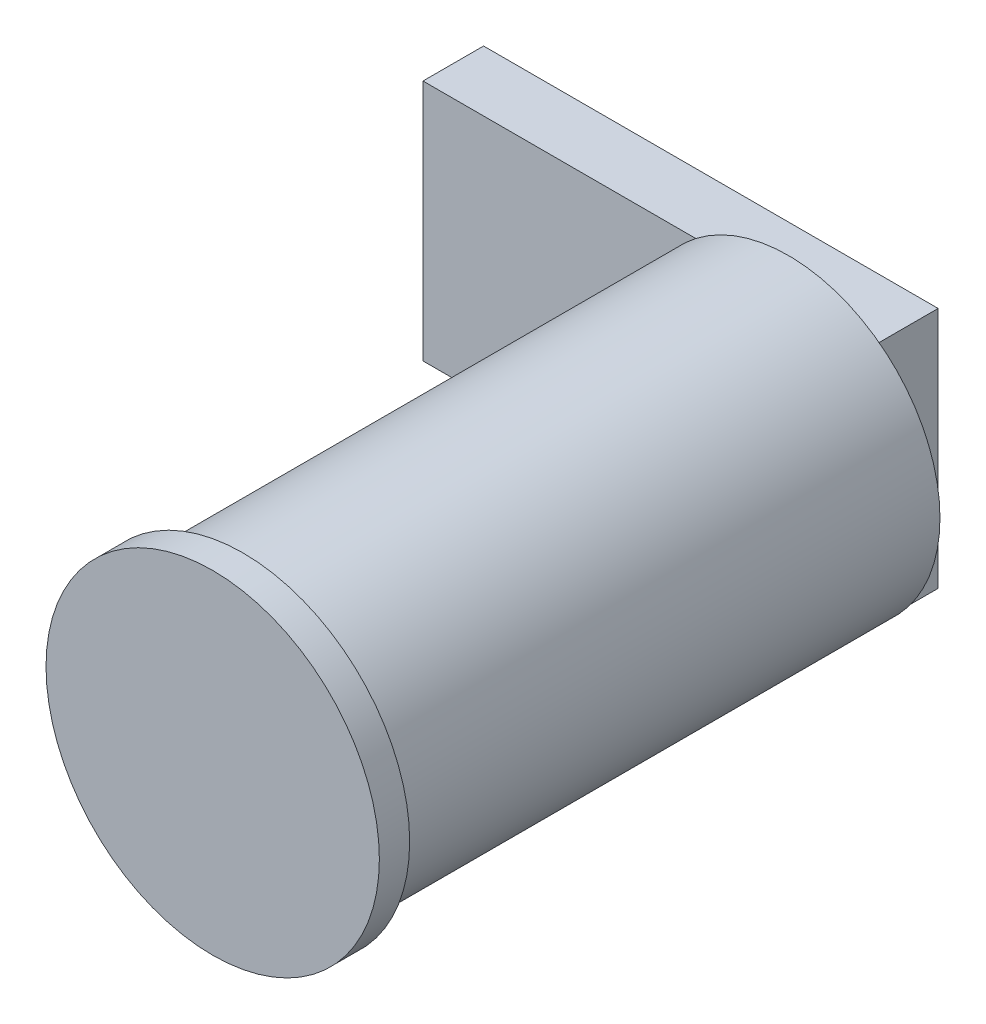
ISO-10303-21;
HEADER;
FILE_DESCRIPTION(('STEP AP214'),'2;1');
FILE_NAME('part.step','',(''),(''),'','','');
FILE_SCHEMA(('AUTOMOTIVE_DESIGN { 1 0 10303 214 1 1 1 1 }'));
ENDSEC;
DATA;
#1=APPLICATION_CONTEXT('core data for automotive mechanical design processes');
#2=APPLICATION_PROTOCOL_DEFINITION('international standard','automotive_design',2000,#1);
#3=PRODUCT_CONTEXT('',#1,'mechanical');
#4=PRODUCT('Part','Part','',(#3));
#5=PRODUCT_RELATED_PRODUCT_CATEGORY('part','',(#4));
#6=PRODUCT_DEFINITION_FORMATION('','',#4);
#7=PRODUCT_DEFINITION_CONTEXT('part definition',#1,'design');
#8=PRODUCT_DEFINITION('design','',#6,#7);
#9=PRODUCT_DEFINITION_SHAPE('','',#8);
#10=(LENGTH_UNIT() NAMED_UNIT(*) SI_UNIT(.MILLI.,.METRE.));
#11=(NAMED_UNIT(*) PLANE_ANGLE_UNIT() SI_UNIT($,.RADIAN.));
#12=(NAMED_UNIT(*) SI_UNIT($,.STERADIAN.) SOLID_ANGLE_UNIT());
#13=UNCERTAINTY_MEASURE_WITH_UNIT(LENGTH_MEASURE(1.E-05),#10,'distance_accuracy_value','');
#14=(GEOMETRIC_REPRESENTATION_CONTEXT(3) GLOBAL_UNCERTAINTY_ASSIGNED_CONTEXT((#13)) GLOBAL_UNIT_ASSIGNED_CONTEXT((#10,
#11,#12)) REPRESENTATION_CONTEXT('',''));
#15=CARTESIAN_POINT('',(0.,0.,0.));
#16=DIRECTION('',(0.,0.,1.));
#17=DIRECTION('',(1.,0.,0.));
#18=AXIS2_PLACEMENT_3D('',#15,#16,#17);
#19=CARTESIAN_POINT('',(0.,0.,-19.));
#20=DIRECTION('',(0.,0.,1.));
#21=DIRECTION('',(1.,0.,0.));
#22=AXIS2_PLACEMENT_3D('',#19,#20,#21);
#23=PLANE('',#22);
#24=DIRECTION('',(1.,0.,0.));
#25=VECTOR('',#24,1.);
#26=CARTESIAN_POINT('',(2.93924574656835,3.95576033997713,-19.));
#27=LINE('',#26,#25);
#28=CARTESIAN_POINT('',(-3.05809746945123,3.95576033997713,-19.));
#29=VERTEX_POINT('',#28);
#30=CARTESIAN_POINT('',(2.93924574656835,3.95576033997713,-19.));
#31=VERTEX_POINT('',#30);
#32=EDGE_CURVE('E11',#29,#31,#27,.T.);
#33=ORIENTED_EDGE('',*,*,#32,.F.);
#34=CARTESIAN_POINT('',(0.,0.,-19.));
#35=DIRECTION('',(0.,0.,1.));
#36=DIRECTION('',(1.,0.,0.));
#37=AXIS2_PLACEMENT_3D('',#34,#35,#36);
#38=CIRCLE('',#37,5.);
#39=CARTESIAN_POINT('',(2.93924574656835,-4.04485283308057,-19.));
#40=VERTEX_POINT('',#39);
#41=EDGE_CURVE('E104',#40,#29,#38,.T.);
#42=ORIENTED_EDGE('',*,*,#41,.F.);
#43=DIRECTION('',(0.,-1.,0.));
#44=VECTOR('',#43,1.);
#45=CARTESIAN_POINT('',(2.93924574656835,-4.04485283308057,-19.));
#46=LINE('',#45,#44);
#47=EDGE_CURVE('E51',#31,#40,#46,.T.);
#48=ORIENTED_EDGE('',*,*,#47,.F.);
#49=EDGE_LOOP('',(#33,#42,#48));
#50=FACE_BOUND('',#49,.T.);
#51=ADVANCED_FACE('F33',(#50),#23,.F.);
#52=DIRECTION('',(-1.,0.,0.));
#53=VECTOR('',#52,1.);
#54=CARTESIAN_POINT('',(2.93924574656835,-4.04485283308057,-19.));
#55=LINE('',#54,#53);
#56=CARTESIAN_POINT('',(-2.93924574656835,-4.04485283308057,-19.));
#57=VERTEX_POINT('',#56);
#58=EDGE_CURVE('E57',#40,#57,#55,.T.);
#59=ORIENTED_EDGE('',*,*,#58,.F.);
#60=EDGE_CURVE('E107',#57,#40,#38,.T.);
#61=ORIENTED_EDGE('',*,*,#60,.F.);
#62=EDGE_LOOP('',(#59,#61));
#63=FACE_BOUND('',#62,.T.);
#64=ADVANCED_FACE('F126',(#63),#23,.F.);
#65=CARTESIAN_POINT('',(0.,0.,-1.));
#66=DIRECTION('',(0.,0.,1.));
#67=DIRECTION('',(1.,0.,0.));
#68=AXIS2_PLACEMENT_3D('',#65,#66,#67);
#69=CYLINDRICAL_SURFACE('',#68,5.5);
#70=CARTESIAN_POINT('',(0.,0.,-1.));
#71=DIRECTION('',(0.,0.,1.));
#72=DIRECTION('',(1.,0.,0.));
#73=AXIS2_PLACEMENT_3D('',#70,#71,#72);
#74=CIRCLE('',#73,5.5);
#75=CARTESIAN_POINT('',(5.5,0.,-1.));
#76=VERTEX_POINT('',#75);
#77=EDGE_CURVE('E42',#76,#76,#74,.T.);
#78=ORIENTED_EDGE('',*,*,#77,.T.);
#79=EDGE_LOOP('',(#78));
#80=FACE_BOUND('',#79,.T.);
#81=CARTESIAN_POINT('',(0.,0.,0.));
#82=DIRECTION('',(0.,0.,1.));
#83=DIRECTION('',(1.,0.,0.));
#84=AXIS2_PLACEMENT_3D('',#81,#82,#83);
#85=CIRCLE('',#84,5.5);
#86=CARTESIAN_POINT('',(5.5,0.,0.));
#87=VERTEX_POINT('',#86);
#88=EDGE_CURVE('E37',#87,#87,#85,.T.);
#89=ORIENTED_EDGE('',*,*,#88,.F.);
#90=EDGE_LOOP('',(#89));
#91=FACE_BOUND('',#90,.T.);
#92=ADVANCED_FACE('F35',(#80,#91),#69,.T.);
#93=CARTESIAN_POINT('',(0.,0.,-1.));
#94=DIRECTION('',(0.,0.,1.));
#95=DIRECTION('',(1.,0.,0.));
#96=AXIS2_PLACEMENT_3D('',#93,#94,#95);
#97=PLANE('',#96);
#98=CARTESIAN_POINT('',(0.,0.,-1.));
#99=DIRECTION('',(0.,0.,1.));
#100=DIRECTION('',(1.,0.,0.));
#101=AXIS2_PLACEMENT_3D('',#98,#99,#100);
#102=CIRCLE('',#101,5.);
#103=CARTESIAN_POINT('',(5.,0.,-1.));
#104=VERTEX_POINT('',#103);
#105=EDGE_CURVE('E114',#104,#104,#102,.T.);
#106=ORIENTED_EDGE('',*,*,#105,.T.);
#107=EDGE_LOOP('',(#106));
#108=FACE_BOUND('',#107,.T.);
#109=ORIENTED_EDGE('',*,*,#77,.F.);
#110=EDGE_LOOP('',(#109));
#111=FACE_BOUND('',#110,.T.);
#112=ADVANCED_FACE('F125',(#108,#111),#97,.F.);
#113=CARTESIAN_POINT('',(0.,0.,0.));
#114=DIRECTION('',(0.,0.,1.));
#115=DIRECTION('',(1.,0.,0.));
#116=AXIS2_PLACEMENT_3D('',#113,#114,#115);
#117=PLANE('',#116);
#118=ORIENTED_EDGE('',*,*,#88,.T.);
#119=EDGE_LOOP('',(#118));
#120=FACE_BOUND('',#119,.T.);
#121=ADVANCED_FACE('F122',(#120),#117,.T.);
#122=CARTESIAN_POINT('',(0.,0.,-19.));
#123=DIRECTION('',(0.,0.,1.));
#124=DIRECTION('',(1.,0.,0.));
#125=AXIS2_PLACEMENT_3D('',#122,#123,#124);
#126=CYLINDRICAL_SURFACE('',#125,5.);
#127=EDGE_CURVE('E109',#29,#57,#38,.T.);
#128=ORIENTED_EDGE('',*,*,#127,.T.);
#129=ORIENTED_EDGE('',*,*,#60,.T.);
#130=ORIENTED_EDGE('',*,*,#41,.T.);
#131=EDGE_LOOP('',(#128,#129,#130));
#132=FACE_BOUND('',#131,.T.);
#133=ORIENTED_EDGE('',*,*,#105,.F.);
#134=EDGE_LOOP('',(#133));
#135=FACE_BOUND('',#134,.T.);
#136=ADVANCED_FACE('F140',(#132,#135),#126,.T.);
#137=CARTESIAN_POINT('',(0.,0.,-19.));
#138=DIRECTION('',(0.,0.,1.));
#139=DIRECTION('',(1.,0.,0.));
#140=AXIS2_PLACEMENT_3D('',#137,#138,#139);
#141=PLANE('',#140);
#142=ORIENTED_EDGE('',*,*,#127,.F.);
#143=CARTESIAN_POINT('',(-12.0607542534317,3.95576033997713,-19.));
#144=VERTEX_POINT('',#143);
#145=EDGE_CURVE('E44',#144,#29,#27,.T.);
#146=ORIENTED_EDGE('',*,*,#145,.F.);
#147=DIRECTION('',(0.,1.,0.));
#148=VECTOR('',#147,1.);
#149=CARTESIAN_POINT('',(-12.0607542534317,-4.04485283308057,-19.));
#150=LINE('',#149,#148);
#151=CARTESIAN_POINT('',(-12.0607542534317,-4.04485283308057,-19.));
#152=VERTEX_POINT('',#151);
#153=EDGE_CURVE('E237',#152,#144,#150,.T.);
#154=ORIENTED_EDGE('',*,*,#153,.F.);
#155=EDGE_CURVE('E245',#57,#152,#55,.T.);
#156=ORIENTED_EDGE('',*,*,#155,.F.);
#157=EDGE_LOOP('',(#142,#146,#154,#156));
#158=FACE_BOUND('',#157,.T.);
#159=ADVANCED_FACE('F142',(#158),#141,.T.);
#160=CARTESIAN_POINT('',(2.93924574656835,-4.04485283308057,-21.));
#161=DIRECTION('',(-1.,0.,0.));
#162=DIRECTION('',(0.,0.,1.));
#163=AXIS2_PLACEMENT_3D('',#160,#161,#162);
#164=PLANE('',#163);
#165=ORIENTED_EDGE('',*,*,#47,.T.);
#166=DIRECTION('',(0.,0.,1.));
#167=VECTOR('',#166,1.);
#168=CARTESIAN_POINT('',(2.93924574656835,-4.04485283308057,-21.));
#169=LINE('',#168,#167);
#170=CARTESIAN_POINT('',(2.93924574656835,-4.04485283308057,-21.));
#171=VERTEX_POINT('',#170);
#172=EDGE_CURVE('E87',#171,#40,#169,.T.);
#173=ORIENTED_EDGE('',*,*,#172,.F.);
#174=DIRECTION('',(0.,-1.,0.));
#175=VECTOR('',#174,1.);
#176=CARTESIAN_POINT('',(2.93924574656835,-4.04485283308057,-21.));
#177=LINE('',#176,#175);
#178=CARTESIAN_POINT('',(2.93924574656835,3.95576033997713,-21.));
#179=VERTEX_POINT('',#178);
#180=EDGE_CURVE('E93',#179,#171,#177,.T.);
#181=ORIENTED_EDGE('',*,*,#180,.F.);
#182=DIRECTION('',(0.,0.,1.));
#183=VECTOR('',#182,1.);
#184=CARTESIAN_POINT('',(2.93924574656835,3.95576033997713,-21.));
#185=LINE('',#184,#183);
#186=EDGE_CURVE('E241',#179,#31,#185,.T.);
#187=ORIENTED_EDGE('',*,*,#186,.T.);
#188=EDGE_LOOP('',(#165,#173,#181,#187));
#189=FACE_BOUND('',#188,.T.);
#190=ADVANCED_FACE('F103',(#189),#164,.F.);
#191=CARTESIAN_POINT('',(2.93924574656835,-4.04485283308057,-21.));
#192=DIRECTION('',(0.,1.,0.));
#193=DIRECTION('',(0.,0.,1.));
#194=AXIS2_PLACEMENT_3D('',#191,#192,#193);
#195=PLANE('',#194);
#196=ORIENTED_EDGE('',*,*,#58,.T.);
#197=ORIENTED_EDGE('',*,*,#155,.T.);
#198=DIRECTION('',(0.,0.,1.));
#199=VECTOR('',#198,1.);
#200=CARTESIAN_POINT('',(-12.0607542534317,-4.04485283308057,-21.));
#201=LINE('',#200,#199);
#202=CARTESIAN_POINT('',(-12.0607542534317,-4.04485283308057,-21.));
#203=VERTEX_POINT('',#202);
#204=EDGE_CURVE('E89',#203,#152,#201,.T.);
#205=ORIENTED_EDGE('',*,*,#204,.F.);
#206=DIRECTION('',(-1.,0.,0.));
#207=VECTOR('',#206,1.);
#208=CARTESIAN_POINT('',(2.93924574656835,-4.04485283308057,-21.));
#209=LINE('',#208,#207);
#210=EDGE_CURVE('E83',#171,#203,#209,.T.);
#211=ORIENTED_EDGE('',*,*,#210,.F.);
#212=ORIENTED_EDGE('',*,*,#172,.T.);
#213=EDGE_LOOP('',(#196,#197,#205,#211,#212));
#214=FACE_BOUND('',#213,.T.);
#215=ADVANCED_FACE('F85',(#214),#195,.F.);
#216=CARTESIAN_POINT('',(-12.0607542534317,-4.04485283308057,-21.));
#217=DIRECTION('',(1.,0.,0.));
#218=DIRECTION('',(0.,0.,-1.));
#219=AXIS2_PLACEMENT_3D('',#216,#217,#218);
#220=PLANE('',#219);
#221=ORIENTED_EDGE('',*,*,#153,.T.);
#222=DIRECTION('',(0.,0.,1.));
#223=VECTOR('',#222,1.);
#224=CARTESIAN_POINT('',(-12.0607542534317,3.95576033997713,-21.));
#225=LINE('',#224,#223);
#226=CARTESIAN_POINT('',(-12.0607542534317,3.95576033997713,-21.));
#227=VERTEX_POINT('',#226);
#228=EDGE_CURVE('E110',#227,#144,#225,.T.);
#229=ORIENTED_EDGE('',*,*,#228,.F.);
#230=DIRECTION('',(0.,1.,0.));
#231=VECTOR('',#230,1.);
#232=CARTESIAN_POINT('',(-12.0607542534317,-4.04485283308057,-21.));
#233=LINE('',#232,#231);
#234=EDGE_CURVE('E92',#203,#227,#233,.T.);
#235=ORIENTED_EDGE('',*,*,#234,.F.);
#236=ORIENTED_EDGE('',*,*,#204,.T.);
#237=EDGE_LOOP('',(#221,#229,#235,#236));
#238=FACE_BOUND('',#237,.T.);
#239=ADVANCED_FACE('F172',(#238),#220,.F.);
#240=CARTESIAN_POINT('',(2.93924574656835,3.95576033997713,-21.));
#241=DIRECTION('',(0.,-1.,0.));
#242=DIRECTION('',(0.,0.,-1.));
#243=AXIS2_PLACEMENT_3D('',#240,#241,#242);
#244=PLANE('',#243);
#245=ORIENTED_EDGE('',*,*,#145,.T.);
#246=ORIENTED_EDGE('',*,*,#32,.T.);
#247=ORIENTED_EDGE('',*,*,#186,.F.);
#248=DIRECTION('',(1.,0.,0.));
#249=VECTOR('',#248,1.);
#250=CARTESIAN_POINT('',(2.93924574656835,3.95576033997713,-21.));
#251=LINE('',#250,#249);
#252=EDGE_CURVE('E98',#227,#179,#251,.T.);
#253=ORIENTED_EDGE('',*,*,#252,.F.);
#254=ORIENTED_EDGE('',*,*,#228,.T.);
#255=EDGE_LOOP('',(#245,#246,#247,#253,#254));
#256=FACE_BOUND('',#255,.T.);
#257=ADVANCED_FACE('F178',(#256),#244,.F.);
#258=CARTESIAN_POINT('',(0.,0.,-21.));
#259=DIRECTION('',(0.,0.,1.));
#260=DIRECTION('',(1.,0.,0.));
#261=AXIS2_PLACEMENT_3D('',#258,#259,#260);
#262=PLANE('',#261);
#263=ORIENTED_EDGE('',*,*,#180,.T.);
#264=ORIENTED_EDGE('',*,*,#210,.T.);
#265=ORIENTED_EDGE('',*,*,#234,.T.);
#266=ORIENTED_EDGE('',*,*,#252,.T.);
#267=EDGE_LOOP('',(#263,#264,#265,#266));
#268=FACE_BOUND('',#267,.T.);
#269=ADVANCED_FACE('F96',(#268),#262,.F.);
#270=CLOSED_SHELL('',(#51,#64,#92,#112,#121,#136,#159,#190,#215,#239,#257,#269));
#271=MANIFOLD_SOLID_BREP('B2',#270);
#272=ADVANCED_BREP_SHAPE_REPRESENTATION('',(#18,#271),#14);
#273=SHAPE_DEFINITION_REPRESENTATION(#9,#272);
ENDSEC;
END-ISO-10303-21;
